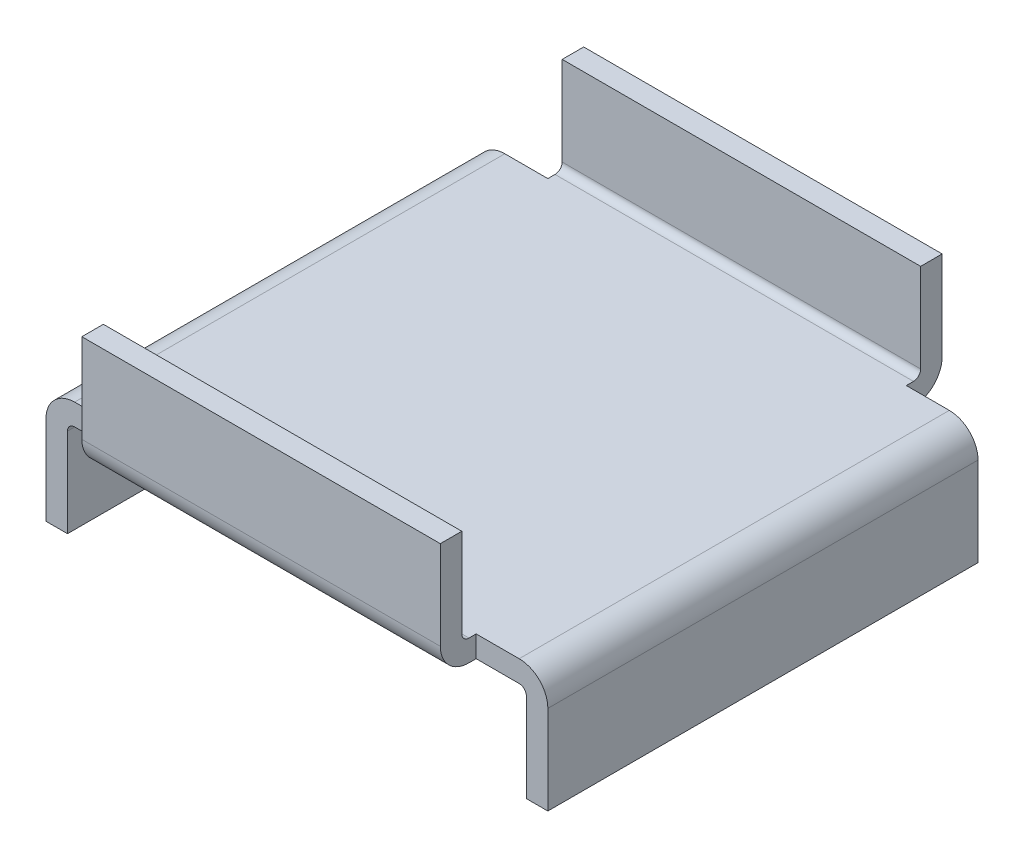
ISO-10303-21;
HEADER;
FILE_DESCRIPTION(('STEP AP214'),'2;1');
FILE_NAME('part.step','',(''),(''),'','','');
FILE_SCHEMA(('AUTOMOTIVE_DESIGN { 1 0 10303 214 1 1 1 1 }'));
ENDSEC;
DATA;
#1=APPLICATION_CONTEXT('core data for automotive mechanical design processes');
#2=APPLICATION_PROTOCOL_DEFINITION('international standard','automotive_design',2000,#1);
#3=PRODUCT_CONTEXT('',#1,'mechanical');
#4=PRODUCT('Part','Part','',(#3));
#5=PRODUCT_RELATED_PRODUCT_CATEGORY('part','',(#4));
#6=PRODUCT_DEFINITION_FORMATION('','',#4);
#7=PRODUCT_DEFINITION_CONTEXT('part definition',#1,'design');
#8=PRODUCT_DEFINITION('design','',#6,#7);
#9=PRODUCT_DEFINITION_SHAPE('','',#8);
#10=(LENGTH_UNIT() NAMED_UNIT(*) SI_UNIT(.MILLI.,.METRE.));
#11=(NAMED_UNIT(*) PLANE_ANGLE_UNIT() SI_UNIT($,.RADIAN.));
#12=(NAMED_UNIT(*) SI_UNIT($,.STERADIAN.) SOLID_ANGLE_UNIT());
#13=UNCERTAINTY_MEASURE_WITH_UNIT(LENGTH_MEASURE(1.E-05),#10,'distance_accuracy_value','');
#14=(GEOMETRIC_REPRESENTATION_CONTEXT(3) GLOBAL_UNCERTAINTY_ASSIGNED_CONTEXT((#13)) GLOBAL_UNIT_ASSIGNED_CONTEXT((#10,
#11,#12)) REPRESENTATION_CONTEXT('',''));
#15=CARTESIAN_POINT('',(0.,0.,0.));
#16=DIRECTION('',(0.,0.,1.));
#17=DIRECTION('',(1.,0.,0.));
#18=AXIS2_PLACEMENT_3D('',#15,#16,#17);
#19=CARTESIAN_POINT('',(0.,-1.5,0.));
#20=DIRECTION('',(0.,1.,0.));
#21=DIRECTION('',(0.,0.,1.));
#22=AXIS2_PLACEMENT_3D('',#19,#20,#21);
#23=PLANE('',#22);
#24=DIRECTION('',(0.,0.,1.));
#25=VECTOR('',#24,1.);
#26=CARTESIAN_POINT('',(-12.5,-1.5,-17.5));
#27=LINE('',#26,#25);
#28=CARTESIAN_POINT('',(-12.5,-1.5,-15.5));
#29=VERTEX_POINT('',#28);
#30=CARTESIAN_POINT('',(-12.5,-1.5,-15.));
#31=VERTEX_POINT('',#30);
#32=EDGE_CURVE('E326',#29,#31,#27,.T.);
#33=ORIENTED_EDGE('',*,*,#32,.F.);
#34=DIRECTION('',(-1.,0.,0.));
#35=VECTOR('',#34,1.);
#36=CARTESIAN_POINT('',(12.5,-1.5,-15.5));
#37=LINE('',#36,#35);
#38=CARTESIAN_POINT('',(12.5,-1.5,-15.5));
#39=VERTEX_POINT('',#38);
#40=EDGE_CURVE('E390',#29,#39,#37,.F.);
#41=ORIENTED_EDGE('',*,*,#40,.T.);
#42=DIRECTION('',(0.,0.,-1.));
#43=VECTOR('',#42,1.);
#44=CARTESIAN_POINT('',(12.5,-1.5,17.5));
#45=LINE('',#44,#43);
#46=CARTESIAN_POINT('',(12.5,-1.5,-15.));
#47=VERTEX_POINT('',#46);
#48=EDGE_CURVE('E325',#47,#39,#45,.T.);
#49=ORIENTED_EDGE('',*,*,#48,.F.);
#50=DIRECTION('',(-1.,0.,0.));
#51=VECTOR('',#50,1.);
#52=CARTESIAN_POINT('',(17.5,-1.5,-15.));
#53=LINE('',#52,#51);
#54=CARTESIAN_POINT('',(15.5000000000023,-1.5,-15.));
#55=VERTEX_POINT('',#54);
#56=EDGE_CURVE('E260',#55,#47,#53,.T.);
#57=ORIENTED_EDGE('',*,*,#56,.F.);
#58=DIRECTION('',(0.,0.,-1.));
#59=VECTOR('',#58,1.);
#60=CARTESIAN_POINT('',(15.5000000000023,-1.5,15.));
#61=LINE('',#60,#59);
#62=CARTESIAN_POINT('',(15.5000000000023,-1.5,15.));
#63=VERTEX_POINT('',#62);
#64=EDGE_CURVE('E352',#55,#63,#61,.F.);
#65=ORIENTED_EDGE('',*,*,#64,.T.);
#66=DIRECTION('',(-1.,0.,0.));
#67=VECTOR('',#66,1.);
#68=CARTESIAN_POINT('',(17.5,-1.5,15.));
#69=LINE('',#68,#67);
#70=CARTESIAN_POINT('',(12.5,-1.5,15.));
#71=VERTEX_POINT('',#70);
#72=EDGE_CURVE('E250',#63,#71,#69,.T.);
#73=ORIENTED_EDGE('',*,*,#72,.T.);
#74=CARTESIAN_POINT('',(12.5,-1.5,15.5));
#75=VERTEX_POINT('',#74);
#76=EDGE_CURVE('E322',#75,#71,#45,.T.);
#77=ORIENTED_EDGE('',*,*,#76,.F.);
#78=DIRECTION('',(1.,0.,0.));
#79=VECTOR('',#78,1.);
#80=CARTESIAN_POINT('',(-12.5,-1.5,15.5));
#81=LINE('',#80,#79);
#82=CARTESIAN_POINT('',(-12.5,-1.5,15.5));
#83=VERTEX_POINT('',#82);
#84=EDGE_CURVE('E388',#75,#83,#81,.F.);
#85=ORIENTED_EDGE('',*,*,#84,.T.);
#86=CARTESIAN_POINT('',(-12.5,-1.5,14.9999999999995));
#87=VERTEX_POINT('',#86);
#88=EDGE_CURVE('E324',#87,#83,#27,.T.);
#89=ORIENTED_EDGE('',*,*,#88,.F.);
#90=DIRECTION('',(1.,0.,0.));
#91=VECTOR('',#90,1.);
#92=CARTESIAN_POINT('',(-17.5,-1.5,14.9999999999995));
#93=LINE('',#92,#91);
#94=CARTESIAN_POINT('',(-15.5,-1.5,14.9999999999995));
#95=VERTEX_POINT('',#94);
#96=EDGE_CURVE('E285',#95,#87,#93,.T.);
#97=ORIENTED_EDGE('',*,*,#96,.F.);
#98=DIRECTION('',(0.,0.,1.));
#99=VECTOR('',#98,1.);
#100=CARTESIAN_POINT('',(-15.5,-1.5,-15.));
#101=LINE('',#100,#99);
#102=CARTESIAN_POINT('',(-15.5,-1.5,-15.));
#103=VERTEX_POINT('',#102);
#104=EDGE_CURVE('E350',#95,#103,#101,.F.);
#105=ORIENTED_EDGE('',*,*,#104,.T.);
#106=DIRECTION('',(1.,0.,0.));
#107=VECTOR('',#106,1.);
#108=CARTESIAN_POINT('',(-17.5,-1.5,-15.));
#109=LINE('',#108,#107);
#110=EDGE_CURVE('E291',#103,#31,#109,.T.);
#111=ORIENTED_EDGE('',*,*,#110,.T.);
#112=EDGE_LOOP('',(#33,#41,#49,#57,#65,#73,#77,#85,#89,#97,#105,#111));
#113=FACE_BOUND('',#112,.T.);
#114=ADVANCED_FACE('F32',(#113),#23,.F.);
#115=CARTESIAN_POINT('',(12.5,-1.5,17.5));
#116=DIRECTION('',(1.,0.,0.));
#117=DIRECTION('',(0.,0.,-1.));
#118=AXIS2_PLACEMENT_3D('',#115,#116,#117);
#119=PLANE('',#118);
#120=DIRECTION('',(0.,1.,0.));
#121=VECTOR('',#120,1.);
#122=CARTESIAN_POINT('',(12.5,-1.5,17.5));
#123=LINE('',#122,#121);
#124=CARTESIAN_POINT('',(12.5,0.500000000000006,17.5));
#125=VERTEX_POINT('',#124);
#126=CARTESIAN_POINT('',(12.5,6.7,17.5));
#127=VERTEX_POINT('',#126);
#128=EDGE_CURVE('E328',#125,#127,#123,.T.);
#129=ORIENTED_EDGE('',*,*,#128,.F.);
#130=CARTESIAN_POINT('',(12.5,0.500000000000006,15.5));
#131=DIRECTION('',(1.,0.,0.));
#132=DIRECTION('',(0.,0.,-1.));
#133=AXIS2_PLACEMENT_3D('',#130,#131,#132);
#134=CIRCLE('',#133,2.);
#135=EDGE_CURVE('E397',#125,#75,#134,.T.);
#136=ORIENTED_EDGE('',*,*,#135,.T.);
#137=ORIENTED_EDGE('',*,*,#76,.T.);
#138=DIRECTION('',(0.,-1.,0.));
#139=VECTOR('',#138,1.);
#140=CARTESIAN_POINT('',(12.5,-1.5,15.));
#141=LINE('',#140,#139);
#142=CARTESIAN_POINT('',(12.5,0.,15.));
#143=VERTEX_POINT('',#142);
#144=EDGE_CURVE('E243',#143,#71,#141,.T.);
#145=ORIENTED_EDGE('',*,*,#144,.F.);
#146=DIRECTION('',(0.,0.,-1.));
#147=VECTOR('',#146,1.);
#148=CARTESIAN_POINT('',(12.5,0.,16.));
#149=LINE('',#148,#147);
#150=CARTESIAN_POINT('',(12.5,0.,15.5));
#151=VERTEX_POINT('',#150);
#152=EDGE_CURVE('E302',#151,#143,#149,.T.);
#153=ORIENTED_EDGE('',*,*,#152,.F.);
#154=CARTESIAN_POINT('',(12.5,0.5,15.5));
#155=DIRECTION('',(1.,0.,0.));
#156=DIRECTION('',(0.,0.,-1.));
#157=AXIS2_PLACEMENT_3D('',#154,#155,#156);
#158=CIRCLE('',#157,0.5);
#159=CARTESIAN_POINT('',(12.5,0.5,16.));
#160=VERTEX_POINT('',#159);
#161=EDGE_CURVE('E371',#151,#160,#158,.F.);
#162=ORIENTED_EDGE('',*,*,#161,.T.);
#163=DIRECTION('',(0.,-1.,0.));
#164=VECTOR('',#163,1.);
#165=CARTESIAN_POINT('',(12.5,6.7,16.));
#166=LINE('',#165,#164);
#167=CARTESIAN_POINT('',(12.5,6.7,16.));
#168=VERTEX_POINT('',#167);
#169=EDGE_CURVE('E311',#168,#160,#166,.T.);
#170=ORIENTED_EDGE('',*,*,#169,.F.);
#171=DIRECTION('',(0.,0.,-1.));
#172=VECTOR('',#171,1.);
#173=CARTESIAN_POINT('',(12.5,6.7,17.5));
#174=LINE('',#173,#172);
#175=EDGE_CURVE('E332',#127,#168,#174,.T.);
#176=ORIENTED_EDGE('',*,*,#175,.F.);
#177=EDGE_LOOP('',(#129,#136,#137,#145,#153,#162,#170,#176));
#178=FACE_BOUND('',#177,.T.);
#179=ADVANCED_FACE('F515',(#178),#119,.T.);
#180=CARTESIAN_POINT('',(-12.5,-1.5,-17.5));
#181=DIRECTION('',(-1.,0.,0.));
#182=DIRECTION('',(0.,0.,1.));
#183=AXIS2_PLACEMENT_3D('',#180,#181,#182);
#184=PLANE('',#183);
#185=ORIENTED_EDGE('',*,*,#88,.T.);
#186=CARTESIAN_POINT('',(-12.5,0.500000000000006,15.5));
#187=DIRECTION('',(-1.,0.,0.));
#188=DIRECTION('',(0.,0.,1.));
#189=AXIS2_PLACEMENT_3D('',#186,#187,#188);
#190=CIRCLE('',#189,2.);
#191=CARTESIAN_POINT('',(-12.5,0.500000000000006,17.5));
#192=VERTEX_POINT('',#191);
#193=EDGE_CURVE('E399',#83,#192,#190,.T.);
#194=ORIENTED_EDGE('',*,*,#193,.T.);
#195=DIRECTION('',(0.,1.,0.));
#196=VECTOR('',#195,1.);
#197=CARTESIAN_POINT('',(-12.5,-1.5,17.5));
#198=LINE('',#197,#196);
#199=CARTESIAN_POINT('',(-12.5,6.7,17.5));
#200=VERTEX_POINT('',#199);
#201=EDGE_CURVE('E342',#192,#200,#198,.T.);
#202=ORIENTED_EDGE('',*,*,#201,.T.);
#203=DIRECTION('',(0.,0.,1.));
#204=VECTOR('',#203,1.);
#205=CARTESIAN_POINT('',(-12.5,6.7,-17.5));
#206=LINE('',#205,#204);
#207=CARTESIAN_POINT('',(-12.5,6.7,16.));
#208=VERTEX_POINT('',#207);
#209=EDGE_CURVE('E338',#208,#200,#206,.T.);
#210=ORIENTED_EDGE('',*,*,#209,.F.);
#211=DIRECTION('',(0.,-1.,0.));
#212=VECTOR('',#211,1.);
#213=CARTESIAN_POINT('',(-12.5,6.7,16.));
#214=LINE('',#213,#212);
#215=CARTESIAN_POINT('',(-12.5,0.5,16.));
#216=VERTEX_POINT('',#215);
#217=EDGE_CURVE('E301',#208,#216,#214,.T.);
#218=ORIENTED_EDGE('',*,*,#217,.T.);
#219=CARTESIAN_POINT('',(-12.5,0.5,15.5));
#220=DIRECTION('',(-1.,0.,0.));
#221=DIRECTION('',(0.,0.,1.));
#222=AXIS2_PLACEMENT_3D('',#219,#220,#221);
#223=CIRCLE('',#222,0.5);
#224=CARTESIAN_POINT('',(-12.5,0.,15.5));
#225=VERTEX_POINT('',#224);
#226=EDGE_CURVE('E373',#216,#225,#223,.F.);
#227=ORIENTED_EDGE('',*,*,#226,.T.);
#228=DIRECTION('',(0.,0.,-1.));
#229=VECTOR('',#228,1.);
#230=CARTESIAN_POINT('',(-12.5,0.,16.));
#231=LINE('',#230,#229);
#232=CARTESIAN_POINT('',(-12.5,0.,14.9999999999995));
#233=VERTEX_POINT('',#232);
#234=EDGE_CURVE('E306',#225,#233,#231,.T.);
#235=ORIENTED_EDGE('',*,*,#234,.T.);
#236=DIRECTION('',(0.,1.,0.));
#237=VECTOR('',#236,1.);
#238=CARTESIAN_POINT('',(-12.5,0.,14.9999999999995));
#239=LINE('',#238,#237);
#240=EDGE_CURVE('E278',#87,#233,#239,.T.);
#241=ORIENTED_EDGE('',*,*,#240,.F.);
#242=EDGE_LOOP('',(#185,#194,#202,#210,#218,#227,#235,#241));
#243=FACE_BOUND('',#242,.T.);
#244=ADVANCED_FACE('F504',(#243),#184,.T.);
#245=CARTESIAN_POINT('',(0.,6.7,0.));
#246=DIRECTION('',(0.,1.,0.));
#247=DIRECTION('',(0.,0.,1.));
#248=AXIS2_PLACEMENT_3D('',#245,#246,#247);
#249=PLANE('',#248);
#250=DIRECTION('',(1.,0.,0.));
#251=VECTOR('',#250,1.);
#252=CARTESIAN_POINT('',(-12.5,6.7,-16.));
#253=LINE('',#252,#251);
#254=CARTESIAN_POINT('',(-12.5,6.7,-16.));
#255=VERTEX_POINT('',#254);
#256=CARTESIAN_POINT('',(12.5,6.7,-16.));
#257=VERTEX_POINT('',#256);
#258=EDGE_CURVE('E309',#255,#257,#253,.T.);
#259=ORIENTED_EDGE('',*,*,#258,.T.);
#260=CARTESIAN_POINT('',(12.5,6.7,-17.5));
#261=VERTEX_POINT('',#260);
#262=EDGE_CURVE('E331',#257,#261,#174,.T.);
#263=ORIENTED_EDGE('',*,*,#262,.T.);
#264=DIRECTION('',(-1.,0.,0.));
#265=VECTOR('',#264,1.);
#266=CARTESIAN_POINT('',(12.5,6.7,-17.5));
#267=LINE('',#266,#265);
#268=CARTESIAN_POINT('',(-12.5,6.7,-17.5));
#269=VERTEX_POINT('',#268);
#270=EDGE_CURVE('E335',#261,#269,#267,.T.);
#271=ORIENTED_EDGE('',*,*,#270,.T.);
#272=EDGE_CURVE('E339',#269,#255,#206,.T.);
#273=ORIENTED_EDGE('',*,*,#272,.T.);
#274=EDGE_LOOP('',(#259,#263,#271,#273));
#275=FACE_BOUND('',#274,.T.);
#276=ADVANCED_FACE('F455',(#275),#249,.T.);
#277=CARTESIAN_POINT('',(-12.5,-1.5,17.5));
#278=DIRECTION('',(0.,0.,1.));
#279=DIRECTION('',(1.,0.,0.));
#280=AXIS2_PLACEMENT_3D('',#277,#278,#279);
#281=PLANE('',#280);
#282=ORIENTED_EDGE('',*,*,#201,.F.);
#283=DIRECTION('',(1.,0.,0.));
#284=VECTOR('',#283,1.);
#285=CARTESIAN_POINT('',(12.5,0.500000000000006,17.5));
#286=LINE('',#285,#284);
#287=EDGE_CURVE('E394',#192,#125,#286,.T.);
#288=ORIENTED_EDGE('',*,*,#287,.T.);
#289=ORIENTED_EDGE('',*,*,#128,.T.);
#290=DIRECTION('',(1.,0.,0.));
#291=VECTOR('',#290,1.);
#292=CARTESIAN_POINT('',(-12.5,6.7,17.5));
#293=LINE('',#292,#291);
#294=EDGE_CURVE('E319',#200,#127,#293,.T.);
#295=ORIENTED_EDGE('',*,*,#294,.F.);
#296=EDGE_LOOP('',(#282,#288,#289,#295));
#297=FACE_BOUND('',#296,.T.);
#298=ADVANCED_FACE('F528',(#297),#281,.T.);
#299=DIRECTION('',(0.,1.,0.));
#300=VECTOR('',#299,1.);
#301=CARTESIAN_POINT('',(-12.5,-1.5,-17.5));
#302=LINE('',#301,#300);
#303=CARTESIAN_POINT('',(-12.5,0.500000000000006,-17.5));
#304=VERTEX_POINT('',#303);
#305=EDGE_CURVE('E344',#304,#269,#302,.T.);
#306=ORIENTED_EDGE('',*,*,#305,.F.);
#307=CARTESIAN_POINT('',(-12.5,0.500000000000006,-15.5));
#308=DIRECTION('',(-1.,0.,0.));
#309=DIRECTION('',(0.,0.,1.));
#310=AXIS2_PLACEMENT_3D('',#307,#308,#309);
#311=CIRCLE('',#310,2.);
#312=EDGE_CURVE('E386',#304,#29,#311,.T.);
#313=ORIENTED_EDGE('',*,*,#312,.T.);
#314=ORIENTED_EDGE('',*,*,#32,.T.);
#315=DIRECTION('',(0.,-1.,0.));
#316=VECTOR('',#315,1.);
#317=CARTESIAN_POINT('',(-12.5,-1.5,-15.));
#318=LINE('',#317,#316);
#319=CARTESIAN_POINT('',(-12.5,0.,-15.));
#320=VERTEX_POINT('',#319);
#321=EDGE_CURVE('E283',#320,#31,#318,.T.);
#322=ORIENTED_EDGE('',*,*,#321,.F.);
#323=CARTESIAN_POINT('',(-12.5,0.,-15.5));
#324=VERTEX_POINT('',#323);
#325=EDGE_CURVE('E305',#320,#324,#231,.T.);
#326=ORIENTED_EDGE('',*,*,#325,.T.);
#327=CARTESIAN_POINT('',(-12.5,0.5,-15.5));
#328=DIRECTION('',(-1.,0.,0.));
#329=DIRECTION('',(0.,0.,1.));
#330=AXIS2_PLACEMENT_3D('',#327,#328,#329);
#331=CIRCLE('',#330,0.5);
#332=CARTESIAN_POINT('',(-12.5,0.5,-16.));
#333=VERTEX_POINT('',#332);
#334=EDGE_CURVE('E377',#324,#333,#331,.F.);
#335=ORIENTED_EDGE('',*,*,#334,.T.);
#336=DIRECTION('',(0.,1.,0.));
#337=VECTOR('',#336,1.);
#338=CARTESIAN_POINT('',(-12.5,0.,-16.));
#339=LINE('',#338,#337);
#340=EDGE_CURVE('E299',#333,#255,#339,.T.);
#341=ORIENTED_EDGE('',*,*,#340,.T.);
#342=ORIENTED_EDGE('',*,*,#272,.F.);
#343=EDGE_LOOP('',(#306,#313,#314,#322,#326,#335,#341,#342));
#344=FACE_BOUND('',#343,.T.);
#345=ADVANCED_FACE('F451',(#344),#184,.T.);
#346=CARTESIAN_POINT('',(12.5,-1.5,-17.5));
#347=DIRECTION('',(0.,0.,-1.));
#348=DIRECTION('',(-1.,0.,0.));
#349=AXIS2_PLACEMENT_3D('',#346,#347,#348);
#350=PLANE('',#349);
#351=DIRECTION('',(0.,1.,0.));
#352=VECTOR('',#351,1.);
#353=CARTESIAN_POINT('',(12.5,-1.5,-17.5));
#354=LINE('',#353,#352);
#355=CARTESIAN_POINT('',(12.5,0.500000000000006,-17.5));
#356=VERTEX_POINT('',#355);
#357=EDGE_CURVE('E346',#356,#261,#354,.T.);
#358=ORIENTED_EDGE('',*,*,#357,.F.);
#359=DIRECTION('',(-1.,0.,0.));
#360=VECTOR('',#359,1.);
#361=CARTESIAN_POINT('',(-12.5,0.500000000000006,-17.5));
#362=LINE('',#361,#360);
#363=EDGE_CURVE('E383',#356,#304,#362,.T.);
#364=ORIENTED_EDGE('',*,*,#363,.T.);
#365=ORIENTED_EDGE('',*,*,#305,.T.);
#366=ORIENTED_EDGE('',*,*,#270,.F.);
#367=EDGE_LOOP('',(#358,#364,#365,#366));
#368=FACE_BOUND('',#367,.T.);
#369=ADVANCED_FACE('F447',(#368),#350,.T.);
#370=ORIENTED_EDGE('',*,*,#48,.T.);
#371=CARTESIAN_POINT('',(12.5,0.500000000000006,-15.5));
#372=DIRECTION('',(1.,0.,0.));
#373=DIRECTION('',(0.,0.,-1.));
#374=AXIS2_PLACEMENT_3D('',#371,#372,#373);
#375=CIRCLE('',#374,2.);
#376=EDGE_CURVE('E392',#39,#356,#375,.T.);
#377=ORIENTED_EDGE('',*,*,#376,.T.);
#378=ORIENTED_EDGE('',*,*,#357,.T.);
#379=ORIENTED_EDGE('',*,*,#262,.F.);
#380=DIRECTION('',(0.,1.,0.));
#381=VECTOR('',#380,1.);
#382=CARTESIAN_POINT('',(12.5,0.,-16.));
#383=LINE('',#382,#381);
#384=CARTESIAN_POINT('',(12.5,0.5,-16.));
#385=VERTEX_POINT('',#384);
#386=EDGE_CURVE('E298',#385,#257,#383,.T.);
#387=ORIENTED_EDGE('',*,*,#386,.F.);
#388=CARTESIAN_POINT('',(12.5,0.5,-15.5));
#389=DIRECTION('',(1.,0.,0.));
#390=DIRECTION('',(0.,0.,-1.));
#391=AXIS2_PLACEMENT_3D('',#388,#389,#390);
#392=CIRCLE('',#391,0.5);
#393=CARTESIAN_POINT('',(12.5,0.,-15.5));
#394=VERTEX_POINT('',#393);
#395=EDGE_CURVE('E375',#385,#394,#392,.F.);
#396=ORIENTED_EDGE('',*,*,#395,.T.);
#397=CARTESIAN_POINT('',(12.5,0.,-15.));
#398=VERTEX_POINT('',#397);
#399=EDGE_CURVE('E314',#398,#394,#149,.T.);
#400=ORIENTED_EDGE('',*,*,#399,.F.);
#401=DIRECTION('',(0.,1.,0.));
#402=VECTOR('',#401,1.);
#403=CARTESIAN_POINT('',(12.5,0.,-15.));
#404=LINE('',#403,#402);
#405=EDGE_CURVE('E239',#47,#398,#404,.T.);
#406=ORIENTED_EDGE('',*,*,#405,.F.);
#407=EDGE_LOOP('',(#370,#377,#378,#379,#387,#396,#400,#406));
#408=FACE_BOUND('',#407,.T.);
#409=ADVANCED_FACE('F439',(#408),#119,.T.);
#410=DIRECTION('',(1.,0.,0.));
#411=VECTOR('',#410,1.);
#412=CARTESIAN_POINT('',(-12.5,6.7,16.));
#413=LINE('',#412,#411);
#414=EDGE_CURVE('E317',#208,#168,#413,.T.);
#415=ORIENTED_EDGE('',*,*,#414,.F.);
#416=ORIENTED_EDGE('',*,*,#209,.T.);
#417=ORIENTED_EDGE('',*,*,#294,.T.);
#418=ORIENTED_EDGE('',*,*,#175,.T.);
#419=EDGE_LOOP('',(#415,#416,#417,#418));
#420=FACE_BOUND('',#419,.T.);
#421=ADVANCED_FACE('F523',(#420),#249,.T.);
#422=CARTESIAN_POINT('',(-12.5,0.,-16.));
#423=DIRECTION('',(0.,0.,-1.));
#424=DIRECTION('',(-1.,0.,0.));
#425=AXIS2_PLACEMENT_3D('',#422,#423,#424);
#426=PLANE('',#425);
#427=ORIENTED_EDGE('',*,*,#340,.F.);
#428=DIRECTION('',(1.,0.,0.));
#429=VECTOR('',#428,1.);
#430=CARTESIAN_POINT('',(12.5,0.5,-16.));
#431=LINE('',#430,#429);
#432=EDGE_CURVE('E361',#333,#385,#431,.T.);
#433=ORIENTED_EDGE('',*,*,#432,.T.);
#434=ORIENTED_EDGE('',*,*,#386,.T.);
#435=ORIENTED_EDGE('',*,*,#258,.F.);
#436=EDGE_LOOP('',(#427,#433,#434,#435));
#437=FACE_BOUND('',#436,.T.);
#438=ADVANCED_FACE('F461',(#437),#426,.F.);
#439=CARTESIAN_POINT('',(-12.5,0.,16.));
#440=DIRECTION('',(0.,-1.,0.));
#441=DIRECTION('',(0.,0.,-1.));
#442=AXIS2_PLACEMENT_3D('',#439,#440,#441);
#443=PLANE('',#442);
#444=DIRECTION('',(1.,0.,0.));
#445=VECTOR('',#444,1.);
#446=CARTESIAN_POINT('',(-17.5,0.,-15.));
#447=LINE('',#446,#445);
#448=CARTESIAN_POINT('',(-15.5,0.,-15.));
#449=VERTEX_POINT('',#448);
#450=EDGE_CURVE('E294',#449,#320,#447,.T.);
#451=ORIENTED_EDGE('',*,*,#450,.F.);
#452=DIRECTION('',(0.,0.,-1.));
#453=VECTOR('',#452,1.);
#454=CARTESIAN_POINT('',(-15.5,0.,16.));
#455=LINE('',#454,#453);
#456=CARTESIAN_POINT('',(-15.5,0.,14.9999999999995));
#457=VERTEX_POINT('',#456);
#458=EDGE_CURVE('E408',#449,#457,#455,.F.);
#459=ORIENTED_EDGE('',*,*,#458,.T.);
#460=DIRECTION('',(1.,0.,0.));
#461=VECTOR('',#460,1.);
#462=CARTESIAN_POINT('',(-17.5,0.,14.9999999999995));
#463=LINE('',#462,#461);
#464=EDGE_CURVE('E296',#457,#233,#463,.T.);
#465=ORIENTED_EDGE('',*,*,#464,.T.);
#466=ORIENTED_EDGE('',*,*,#234,.F.);
#467=DIRECTION('',(1.,0.,0.));
#468=VECTOR('',#467,1.);
#469=CARTESIAN_POINT('',(12.5,0.,15.5));
#470=LINE('',#469,#468);
#471=EDGE_CURVE('E356',#225,#151,#470,.T.);
#472=ORIENTED_EDGE('',*,*,#471,.T.);
#473=ORIENTED_EDGE('',*,*,#152,.T.);
#474=DIRECTION('',(-1.,0.,0.));
#475=VECTOR('',#474,1.);
#476=CARTESIAN_POINT('',(17.5,0.,15.));
#477=LINE('',#476,#475);
#478=CARTESIAN_POINT('',(15.5,0.,15.));
#479=VERTEX_POINT('',#478);
#480=EDGE_CURVE('E256',#479,#143,#477,.T.);
#481=ORIENTED_EDGE('',*,*,#480,.F.);
#482=DIRECTION('',(0.,0.,1.));
#483=VECTOR('',#482,1.);
#484=CARTESIAN_POINT('',(15.5,0.,16.));
#485=LINE('',#484,#483);
#486=CARTESIAN_POINT('',(15.5,0.,-15.));
#487=VERTEX_POINT('',#486);
#488=EDGE_CURVE('E406',#479,#487,#485,.F.);
#489=ORIENTED_EDGE('',*,*,#488,.T.);
#490=DIRECTION('',(-1.,0.,0.));
#491=VECTOR('',#490,1.);
#492=CARTESIAN_POINT('',(17.5,0.,-15.));
#493=LINE('',#492,#491);
#494=EDGE_CURVE('E258',#487,#398,#493,.T.);
#495=ORIENTED_EDGE('',*,*,#494,.T.);
#496=ORIENTED_EDGE('',*,*,#399,.T.);
#497=DIRECTION('',(1.,0.,0.));
#498=VECTOR('',#497,1.);
#499=CARTESIAN_POINT('',(-12.5,0.,-15.5));
#500=LINE('',#499,#498);
#501=EDGE_CURVE('E354',#394,#324,#500,.F.);
#502=ORIENTED_EDGE('',*,*,#501,.T.);
#503=ORIENTED_EDGE('',*,*,#325,.F.);
#504=EDGE_LOOP('',(#451,#459,#465,#466,#472,#473,#481,#489,#495,#496,#502,#503));
#505=FACE_BOUND('',#504,.T.);
#506=ADVANCED_FACE('F419',(#505),#443,.F.);
#507=CARTESIAN_POINT('',(-12.5,6.7,16.));
#508=DIRECTION('',(0.,0.,1.));
#509=DIRECTION('',(1.,0.,0.));
#510=AXIS2_PLACEMENT_3D('',#507,#508,#509);
#511=PLANE('',#510);
#512=ORIENTED_EDGE('',*,*,#169,.T.);
#513=DIRECTION('',(1.,0.,0.));
#514=VECTOR('',#513,1.);
#515=CARTESIAN_POINT('',(-12.5,0.5,16.));
#516=LINE('',#515,#514);
#517=EDGE_CURVE('E359',#160,#216,#516,.F.);
#518=ORIENTED_EDGE('',*,*,#517,.T.);
#519=ORIENTED_EDGE('',*,*,#217,.F.);
#520=ORIENTED_EDGE('',*,*,#414,.T.);
#521=EDGE_LOOP('',(#512,#518,#519,#520));
#522=FACE_BOUND('',#521,.T.);
#523=ADVANCED_FACE('F518',(#522),#511,.F.);
#524=CARTESIAN_POINT('',(-17.5,0.,14.9999999999995));
#525=DIRECTION('',(0.,0.,-1.));
#526=DIRECTION('',(0.,1.,0.));
#527=AXIS2_PLACEMENT_3D('',#524,#525,#526);
#528=PLANE('',#527);
#529=ORIENTED_EDGE('',*,*,#464,.F.);
#530=CARTESIAN_POINT('',(-15.5,-2.,14.9999999999995));
#531=DIRECTION('',(0.,0.,-1.));
#532=DIRECTION('',(0.,1.,0.));
#533=AXIS2_PLACEMENT_3D('',#530,#531,#532);
#534=CIRCLE('',#533,2.);
#535=CARTESIAN_POINT('',(-17.5,-2.,14.9999999999995));
#536=VERTEX_POINT('',#535);
#537=EDGE_CURVE('E410',#457,#536,#534,.F.);
#538=ORIENTED_EDGE('',*,*,#537,.T.);
#539=DIRECTION('',(0.,1.,0.));
#540=VECTOR('',#539,1.);
#541=CARTESIAN_POINT('',(-17.5,0.,14.9999999999995));
#542=LINE('',#541,#540);
#543=CARTESIAN_POINT('',(-17.4999999999975,-8.2,14.9999999999995));
#544=VERTEX_POINT('',#543);
#545=EDGE_CURVE('E279',#544,#536,#542,.T.);
#546=ORIENTED_EDGE('',*,*,#545,.F.);
#547=DIRECTION('',(-1.,0.,0.));
#548=VECTOR('',#547,1.);
#549=CARTESIAN_POINT('',(-17.4999999999975,-8.2,14.9999999999995));
#550=LINE('',#549,#548);
#551=CARTESIAN_POINT('',(-16.,-8.2,14.9999999999995));
#552=VERTEX_POINT('',#551);
#553=EDGE_CURVE('E262',#552,#544,#550,.T.);
#554=ORIENTED_EDGE('',*,*,#553,.F.);
#555=DIRECTION('',(0.,1.,0.));
#556=VECTOR('',#555,1.);
#557=CARTESIAN_POINT('',(-16.,-8.2,14.9999999999995));
#558=LINE('',#557,#556);
#559=CARTESIAN_POINT('',(-16.,-2.,14.9999999999995));
#560=VERTEX_POINT('',#559);
#561=EDGE_CURVE('E272',#552,#560,#558,.T.);
#562=ORIENTED_EDGE('',*,*,#561,.T.);
#563=CARTESIAN_POINT('',(-15.5,-2.,14.9999999999995));
#564=DIRECTION('',(0.,0.,-1.));
#565=DIRECTION('',(0.,1.,0.));
#566=AXIS2_PLACEMENT_3D('',#563,#564,#565);
#567=CIRCLE('',#566,0.5);
#568=EDGE_CURVE('E379',#560,#95,#567,.T.);
#569=ORIENTED_EDGE('',*,*,#568,.T.);
#570=ORIENTED_EDGE('',*,*,#96,.T.);
#571=ORIENTED_EDGE('',*,*,#240,.T.);
#572=EDGE_LOOP('',(#529,#538,#546,#554,#562,#569,#570,#571));
#573=FACE_BOUND('',#572,.T.);
#574=ADVANCED_FACE('F482',(#573),#528,.F.);
#575=CARTESIAN_POINT('',(-17.5,-1.5,-15.));
#576=DIRECTION('',(0.,0.,1.));
#577=DIRECTION('',(1.,0.,0.));
#578=AXIS2_PLACEMENT_3D('',#575,#576,#577);
#579=PLANE('',#578);
#580=DIRECTION('',(0.,-1.,0.));
#581=VECTOR('',#580,1.);
#582=CARTESIAN_POINT('',(-17.5,-1.5,-15.));
#583=LINE('',#582,#581);
#584=CARTESIAN_POINT('',(-17.5,-2.,-15.));
#585=VERTEX_POINT('',#584);
#586=CARTESIAN_POINT('',(-17.4999999999975,-8.2,-15.));
#587=VERTEX_POINT('',#586);
#588=EDGE_CURVE('E282',#585,#587,#583,.T.);
#589=ORIENTED_EDGE('',*,*,#588,.F.);
#590=CARTESIAN_POINT('',(-15.5,-2.,-15.));
#591=DIRECTION('',(0.,0.,1.));
#592=DIRECTION('',(1.,0.,0.));
#593=AXIS2_PLACEMENT_3D('',#590,#591,#592);
#594=CIRCLE('',#593,2.);
#595=EDGE_CURVE('E404',#585,#449,#594,.F.);
#596=ORIENTED_EDGE('',*,*,#595,.T.);
#597=ORIENTED_EDGE('',*,*,#450,.T.);
#598=ORIENTED_EDGE('',*,*,#321,.T.);
#599=ORIENTED_EDGE('',*,*,#110,.F.);
#600=CARTESIAN_POINT('',(-15.5,-2.,-15.));
#601=DIRECTION('',(0.,0.,1.));
#602=DIRECTION('',(1.,0.,0.));
#603=AXIS2_PLACEMENT_3D('',#600,#601,#602);
#604=CIRCLE('',#603,0.5);
#605=CARTESIAN_POINT('',(-16.,-2.,-15.));
#606=VERTEX_POINT('',#605);
#607=EDGE_CURVE('E381',#103,#606,#604,.T.);
#608=ORIENTED_EDGE('',*,*,#607,.T.);
#609=DIRECTION('',(0.,1.,0.));
#610=VECTOR('',#609,1.);
#611=CARTESIAN_POINT('',(-16.,-8.2,-15.));
#612=LINE('',#611,#610);
#613=CARTESIAN_POINT('',(-16.,-8.2,-15.));
#614=VERTEX_POINT('',#613);
#615=EDGE_CURVE('E275',#614,#606,#612,.T.);
#616=ORIENTED_EDGE('',*,*,#615,.F.);
#617=DIRECTION('',(1.,0.,0.));
#618=VECTOR('',#617,1.);
#619=CARTESIAN_POINT('',(-16.,-8.2,-15.));
#620=LINE('',#619,#618);
#621=EDGE_CURVE('E268',#587,#614,#620,.T.);
#622=ORIENTED_EDGE('',*,*,#621,.F.);
#623=EDGE_LOOP('',(#589,#596,#597,#598,#599,#608,#616,#622));
#624=FACE_BOUND('',#623,.T.);
#625=ADVANCED_FACE('F473',(#624),#579,.F.);
#626=CARTESIAN_POINT('',(-17.5,0.,0.));
#627=DIRECTION('',(1.,0.,0.));
#628=DIRECTION('',(0.,0.,-1.));
#629=AXIS2_PLACEMENT_3D('',#626,#627,#628);
#630=PLANE('',#629);
#631=ORIENTED_EDGE('',*,*,#545,.T.);
#632=DIRECTION('',(0.,0.,-1.));
#633=VECTOR('',#632,1.);
#634=CARTESIAN_POINT('',(-17.5,-2.,0.));
#635=LINE('',#634,#633);
#636=EDGE_CURVE('E401',#536,#585,#635,.T.);
#637=ORIENTED_EDGE('',*,*,#636,.T.);
#638=ORIENTED_EDGE('',*,*,#588,.T.);
#639=DIRECTION('',(0.,0.,-1.));
#640=VECTOR('',#639,1.);
#641=CARTESIAN_POINT('',(-17.4999999999975,-8.2,-15.));
#642=LINE('',#641,#640);
#643=EDGE_CURVE('E265',#544,#587,#642,.T.);
#644=ORIENTED_EDGE('',*,*,#643,.F.);
#645=EDGE_LOOP('',(#631,#637,#638,#644));
#646=FACE_BOUND('',#645,.T.);
#647=ADVANCED_FACE('F486',(#646),#630,.F.);
#648=CARTESIAN_POINT('',(-16.,-8.2,14.9999999999995));
#649=DIRECTION('',(-1.,0.,0.));
#650=DIRECTION('',(0.,-1.,0.));
#651=AXIS2_PLACEMENT_3D('',#648,#649,#650);
#652=PLANE('',#651);
#653=ORIENTED_EDGE('',*,*,#615,.T.);
#654=DIRECTION('',(0.,0.,1.));
#655=VECTOR('',#654,1.);
#656=CARTESIAN_POINT('',(-16.,-2.,14.9999999999995));
#657=LINE('',#656,#655);
#658=EDGE_CURVE('E364',#606,#560,#657,.T.);
#659=ORIENTED_EDGE('',*,*,#658,.T.);
#660=ORIENTED_EDGE('',*,*,#561,.F.);
#661=DIRECTION('',(0.,0.,1.));
#662=VECTOR('',#661,1.);
#663=CARTESIAN_POINT('',(-16.,-8.2,14.9999999999995));
#664=LINE('',#663,#662);
#665=EDGE_CURVE('E270',#614,#552,#664,.T.);
#666=ORIENTED_EDGE('',*,*,#665,.F.);
#667=EDGE_LOOP('',(#653,#659,#660,#666));
#668=FACE_BOUND('',#667,.T.);
#669=ADVANCED_FACE('F494',(#668),#652,.F.);
#670=CARTESIAN_POINT('',(0.,-8.2,0.));
#671=DIRECTION('',(0.,1.,0.));
#672=DIRECTION('',(0.,0.,1.));
#673=AXIS2_PLACEMENT_3D('',#670,#671,#672);
#674=PLANE('',#673);
#675=ORIENTED_EDGE('',*,*,#553,.T.);
#676=ORIENTED_EDGE('',*,*,#643,.T.);
#677=ORIENTED_EDGE('',*,*,#621,.T.);
#678=ORIENTED_EDGE('',*,*,#665,.T.);
#679=EDGE_LOOP('',(#675,#676,#677,#678));
#680=FACE_BOUND('',#679,.T.);
#681=ADVANCED_FACE('F489',(#680),#674,.F.);
#682=CARTESIAN_POINT('',(17.5,0.,-15.));
#683=DIRECTION('',(0.,0.,1.));
#684=DIRECTION('',(1.,0.,0.));
#685=AXIS2_PLACEMENT_3D('',#682,#683,#684);
#686=PLANE('',#685);
#687=ORIENTED_EDGE('',*,*,#494,.F.);
#688=CARTESIAN_POINT('',(15.5,-2.,-15.));
#689=DIRECTION('',(0.,0.,1.));
#690=DIRECTION('',(1.,0.,0.));
#691=AXIS2_PLACEMENT_3D('',#688,#689,#690);
#692=CIRCLE('',#691,2.);
#693=CARTESIAN_POINT('',(17.5,-2.,-15.));
#694=VERTEX_POINT('',#693);
#695=EDGE_CURVE('E11',#487,#694,#692,.F.);
#696=ORIENTED_EDGE('',*,*,#695,.T.);
#697=DIRECTION('',(0.,1.,0.));
#698=VECTOR('',#697,1.);
#699=CARTESIAN_POINT('',(17.5,0.,-15.));
#700=LINE('',#699,#698);
#701=CARTESIAN_POINT('',(17.5,-8.2,-15.));
#702=VERTEX_POINT('',#701);
#703=EDGE_CURVE('E220',#702,#694,#700,.T.);
#704=ORIENTED_EDGE('',*,*,#703,.F.);
#705=DIRECTION('',(1.,0.,0.));
#706=VECTOR('',#705,1.);
#707=CARTESIAN_POINT('',(17.5,-8.2,-15.));
#708=LINE('',#707,#706);
#709=CARTESIAN_POINT('',(16.0000000000023,-8.2,-15.));
#710=VERTEX_POINT('',#709);
#711=EDGE_CURVE('E215',#710,#702,#708,.T.);
#712=ORIENTED_EDGE('',*,*,#711,.F.);
#713=DIRECTION('',(0.,1.,0.));
#714=VECTOR('',#713,1.);
#715=CARTESIAN_POINT('',(16.0000000000023,-8.2,-15.));
#716=LINE('',#715,#714);
#717=CARTESIAN_POINT('',(16.0000000000023,-2.,-15.));
#718=VERTEX_POINT('',#717);
#719=EDGE_CURVE('E219',#710,#718,#716,.T.);
#720=ORIENTED_EDGE('',*,*,#719,.T.);
#721=CARTESIAN_POINT('',(15.5000000000023,-2.,-15.));
#722=DIRECTION('',(0.,0.,1.));
#723=DIRECTION('',(1.,0.,0.));
#724=AXIS2_PLACEMENT_3D('',#721,#722,#723);
#725=CIRCLE('',#724,0.5);
#726=EDGE_CURVE('E367',#718,#55,#725,.T.);
#727=ORIENTED_EDGE('',*,*,#726,.T.);
#728=ORIENTED_EDGE('',*,*,#56,.T.);
#729=ORIENTED_EDGE('',*,*,#405,.T.);
#730=EDGE_LOOP('',(#687,#696,#704,#712,#720,#727,#728,#729));
#731=FACE_BOUND('',#730,.T.);
#732=ADVANCED_FACE('F217',(#731),#686,.F.);
#733=CARTESIAN_POINT('',(17.5,-1.5,15.));
#734=DIRECTION('',(0.,0.,-1.));
#735=DIRECTION('',(-1.,0.,0.));
#736=AXIS2_PLACEMENT_3D('',#733,#734,#735);
#737=PLANE('',#736);
#738=DIRECTION('',(0.,-1.,0.));
#739=VECTOR('',#738,1.);
#740=CARTESIAN_POINT('',(17.5,-1.5,15.));
#741=LINE('',#740,#739);
#742=CARTESIAN_POINT('',(17.5,-2.,15.));
#743=VERTEX_POINT('',#742);
#744=CARTESIAN_POINT('',(17.5,-8.2,15.));
#745=VERTEX_POINT('',#744);
#746=EDGE_CURVE('E249',#743,#745,#741,.T.);
#747=ORIENTED_EDGE('',*,*,#746,.F.);
#748=CARTESIAN_POINT('',(15.5,-2.,15.));
#749=DIRECTION('',(0.,0.,-1.));
#750=DIRECTION('',(-1.,0.,0.));
#751=AXIS2_PLACEMENT_3D('',#748,#749,#750);
#752=CIRCLE('',#751,2.);
#753=EDGE_CURVE('E40',#743,#479,#752,.F.);
#754=ORIENTED_EDGE('',*,*,#753,.T.);
#755=ORIENTED_EDGE('',*,*,#480,.T.);
#756=ORIENTED_EDGE('',*,*,#144,.T.);
#757=ORIENTED_EDGE('',*,*,#72,.F.);
#758=CARTESIAN_POINT('',(15.5000000000023,-2.,15.));
#759=DIRECTION('',(0.,0.,-1.));
#760=DIRECTION('',(-1.,0.,0.));
#761=AXIS2_PLACEMENT_3D('',#758,#759,#760);
#762=CIRCLE('',#761,0.5);
#763=CARTESIAN_POINT('',(16.0000000000023,-2.,15.));
#764=VERTEX_POINT('',#763);
#765=EDGE_CURVE('E369',#63,#764,#762,.T.);
#766=ORIENTED_EDGE('',*,*,#765,.T.);
#767=DIRECTION('',(0.,1.,0.));
#768=VECTOR('',#767,1.);
#769=CARTESIAN_POINT('',(16.0000000000023,-8.2,15.));
#770=LINE('',#769,#768);
#771=CARTESIAN_POINT('',(16.0000000000023,-8.2,15.));
#772=VERTEX_POINT('',#771);
#773=EDGE_CURVE('E240',#772,#764,#770,.T.);
#774=ORIENTED_EDGE('',*,*,#773,.F.);
#775=DIRECTION('',(-1.,0.,0.));
#776=VECTOR('',#775,1.);
#777=CARTESIAN_POINT('',(16.0000000000023,-8.2,15.));
#778=LINE('',#777,#776);
#779=EDGE_CURVE('E230',#745,#772,#778,.T.);
#780=ORIENTED_EDGE('',*,*,#779,.F.);
#781=EDGE_LOOP('',(#747,#754,#755,#756,#757,#766,#774,#780));
#782=FACE_BOUND('',#781,.T.);
#783=ADVANCED_FACE('F416',(#782),#737,.F.);
#784=CARTESIAN_POINT('',(17.5,0.,0.));
#785=DIRECTION('',(-1.,0.,0.));
#786=DIRECTION('',(0.,0.,1.));
#787=AXIS2_PLACEMENT_3D('',#784,#785,#786);
#788=PLANE('',#787);
#789=ORIENTED_EDGE('',*,*,#703,.T.);
#790=DIRECTION('',(0.,0.,1.));
#791=VECTOR('',#790,1.);
#792=CARTESIAN_POINT('',(17.5,-2.,0.));
#793=LINE('',#792,#791);
#794=EDGE_CURVE('E412',#694,#743,#793,.T.);
#795=ORIENTED_EDGE('',*,*,#794,.T.);
#796=ORIENTED_EDGE('',*,*,#746,.T.);
#797=DIRECTION('',(0.,0.,1.));
#798=VECTOR('',#797,1.);
#799=CARTESIAN_POINT('',(17.5,-8.2,15.));
#800=LINE('',#799,#798);
#801=EDGE_CURVE('E224',#702,#745,#800,.T.);
#802=ORIENTED_EDGE('',*,*,#801,.F.);
#803=EDGE_LOOP('',(#789,#795,#796,#802));
#804=FACE_BOUND('',#803,.T.);
#805=ADVANCED_FACE('F423',(#804),#788,.F.);
#806=CARTESIAN_POINT('',(16.0000000000023,-8.2,-15.));
#807=DIRECTION('',(1.,0.,0.));
#808=DIRECTION('',(0.,1.,0.));
#809=AXIS2_PLACEMENT_3D('',#806,#807,#808);
#810=PLANE('',#809);
#811=ORIENTED_EDGE('',*,*,#773,.T.);
#812=DIRECTION('',(0.,0.,-1.));
#813=VECTOR('',#812,1.);
#814=CARTESIAN_POINT('',(16.0000000000023,-2.,-15.));
#815=LINE('',#814,#813);
#816=EDGE_CURVE('E238',#764,#718,#815,.T.);
#817=ORIENTED_EDGE('',*,*,#816,.T.);
#818=ORIENTED_EDGE('',*,*,#719,.F.);
#819=DIRECTION('',(0.,0.,-1.));
#820=VECTOR('',#819,1.);
#821=CARTESIAN_POINT('',(16.0000000000023,-8.2,-15.));
#822=LINE('',#821,#820);
#823=EDGE_CURVE('E225',#772,#710,#822,.T.);
#824=ORIENTED_EDGE('',*,*,#823,.F.);
#825=EDGE_LOOP('',(#811,#817,#818,#824));
#826=FACE_BOUND('',#825,.T.);
#827=ADVANCED_FACE('F236',(#826),#810,.F.);
#828=CARTESIAN_POINT('',(0.,-8.2,0.));
#829=DIRECTION('',(0.,1.,0.));
#830=DIRECTION('',(0.,0.,1.));
#831=AXIS2_PLACEMENT_3D('',#828,#829,#830);
#832=PLANE('',#831);
#833=ORIENTED_EDGE('',*,*,#823,.T.);
#834=ORIENTED_EDGE('',*,*,#711,.T.);
#835=ORIENTED_EDGE('',*,*,#801,.T.);
#836=ORIENTED_EDGE('',*,*,#779,.T.);
#837=EDGE_LOOP('',(#833,#834,#835,#836));
#838=FACE_BOUND('',#837,.T.);
#839=ADVANCED_FACE('F228',(#838),#832,.F.);
#840=CARTESIAN_POINT('',(15.5000000000023,-2.,-15.));
#841=DIRECTION('',(0.,0.,1.));
#842=DIRECTION('',(1.,0.,0.));
#843=AXIS2_PLACEMENT_3D('',#840,#841,#842);
#844=CYLINDRICAL_SURFACE('',#843,0.5);
#845=ORIENTED_EDGE('',*,*,#765,.F.);
#846=ORIENTED_EDGE('',*,*,#64,.F.);
#847=ORIENTED_EDGE('',*,*,#726,.F.);
#848=ORIENTED_EDGE('',*,*,#816,.F.);
#849=EDGE_LOOP('',(#845,#846,#847,#848));
#850=FACE_BOUND('',#849,.T.);
#851=ADVANCED_FACE('F428',(#850),#844,.F.);
#852=CARTESIAN_POINT('',(-12.5,0.5,15.5));
#853=DIRECTION('',(-1.,0.,0.));
#854=DIRECTION('',(0.,0.,1.));
#855=AXIS2_PLACEMENT_3D('',#852,#853,#854);
#856=CYLINDRICAL_SURFACE('',#855,0.5);
#857=ORIENTED_EDGE('',*,*,#226,.F.);
#858=ORIENTED_EDGE('',*,*,#517,.F.);
#859=ORIENTED_EDGE('',*,*,#161,.F.);
#860=ORIENTED_EDGE('',*,*,#471,.F.);
#861=EDGE_LOOP('',(#857,#858,#859,#860));
#862=FACE_BOUND('',#861,.T.);
#863=ADVANCED_FACE('F510',(#862),#856,.F.);
#864=CARTESIAN_POINT('',(-12.5,0.5,-15.5));
#865=DIRECTION('',(-1.,0.,0.));
#866=DIRECTION('',(0.,0.,1.));
#867=AXIS2_PLACEMENT_3D('',#864,#865,#866);
#868=CYLINDRICAL_SURFACE('',#867,0.5);
#869=ORIENTED_EDGE('',*,*,#334,.F.);
#870=ORIENTED_EDGE('',*,*,#501,.F.);
#871=ORIENTED_EDGE('',*,*,#395,.F.);
#872=ORIENTED_EDGE('',*,*,#432,.F.);
#873=EDGE_LOOP('',(#869,#870,#871,#872));
#874=FACE_BOUND('',#873,.T.);
#875=ADVANCED_FACE('F465',(#874),#868,.F.);
#876=CARTESIAN_POINT('',(-15.5,-2.,14.9999999999995));
#877=DIRECTION('',(0.,0.,-1.));
#878=DIRECTION('',(-1.,0.,0.));
#879=AXIS2_PLACEMENT_3D('',#876,#877,#878);
#880=CYLINDRICAL_SURFACE('',#879,0.5);
#881=ORIENTED_EDGE('',*,*,#607,.F.);
#882=ORIENTED_EDGE('',*,*,#104,.F.);
#883=ORIENTED_EDGE('',*,*,#568,.F.);
#884=ORIENTED_EDGE('',*,*,#658,.F.);
#885=EDGE_LOOP('',(#881,#882,#883,#884));
#886=FACE_BOUND('',#885,.T.);
#887=ADVANCED_FACE('F498',(#886),#880,.F.);
#888=CARTESIAN_POINT('',(12.5,0.500000000000006,-15.5));
#889=DIRECTION('',(1.,0.,0.));
#890=DIRECTION('',(0.,0.,-1.));
#891=AXIS2_PLACEMENT_3D('',#888,#889,#890);
#892=CYLINDRICAL_SURFACE('',#891,2.);
#893=ORIENTED_EDGE('',*,*,#376,.F.);
#894=ORIENTED_EDGE('',*,*,#40,.F.);
#895=ORIENTED_EDGE('',*,*,#312,.F.);
#896=ORIENTED_EDGE('',*,*,#363,.F.);
#897=EDGE_LOOP('',(#893,#894,#895,#896));
#898=FACE_BOUND('',#897,.T.);
#899=ADVANCED_FACE('F444',(#898),#892,.T.);
#900=CARTESIAN_POINT('',(-12.5,0.500000000000006,15.5));
#901=DIRECTION('',(-1.,0.,0.));
#902=DIRECTION('',(0.,0.,1.));
#903=AXIS2_PLACEMENT_3D('',#900,#901,#902);
#904=CYLINDRICAL_SURFACE('',#903,2.);
#905=ORIENTED_EDGE('',*,*,#193,.F.);
#906=ORIENTED_EDGE('',*,*,#84,.F.);
#907=ORIENTED_EDGE('',*,*,#135,.F.);
#908=ORIENTED_EDGE('',*,*,#287,.F.);
#909=EDGE_LOOP('',(#905,#906,#907,#908));
#910=FACE_BOUND('',#909,.T.);
#911=ADVANCED_FACE('F530',(#910),#904,.T.);
#912=CARTESIAN_POINT('',(-15.5,-2.,0.));
#913=DIRECTION('',(0.,0.,-1.));
#914=DIRECTION('',(-1.,0.,0.));
#915=AXIS2_PLACEMENT_3D('',#912,#913,#914);
#916=CYLINDRICAL_SURFACE('',#915,2.);
#917=ORIENTED_EDGE('',*,*,#537,.F.);
#918=ORIENTED_EDGE('',*,*,#458,.F.);
#919=ORIENTED_EDGE('',*,*,#595,.F.);
#920=ORIENTED_EDGE('',*,*,#636,.F.);
#921=EDGE_LOOP('',(#917,#918,#919,#920));
#922=FACE_BOUND('',#921,.T.);
#923=ADVANCED_FACE('F479',(#922),#916,.T.);
#924=CARTESIAN_POINT('',(15.5,-2.,0.));
#925=DIRECTION('',(0.,0.,1.));
#926=DIRECTION('',(1.,0.,0.));
#927=AXIS2_PLACEMENT_3D('',#924,#925,#926);
#928=CYLINDRICAL_SURFACE('',#927,2.);
#929=ORIENTED_EDGE('',*,*,#695,.F.);
#930=ORIENTED_EDGE('',*,*,#488,.F.);
#931=ORIENTED_EDGE('',*,*,#753,.F.);
#932=ORIENTED_EDGE('',*,*,#794,.F.);
#933=EDGE_LOOP('',(#929,#930,#931,#932));
#934=FACE_BOUND('',#933,.T.);
#935=ADVANCED_FACE('F34',(#934),#928,.T.);
#936=CLOSED_SHELL('',(#114,#179,#244,#276,#298,#345,#369,#409,#421,#438,#506,#523,#574,#625,
#647,#669,#681,#732,#783,#805,#827,#839,#851,#863,#875,#887,#899,#911,#923,#935));
#937=MANIFOLD_SOLID_BREP('B2',#936);
#938=ADVANCED_BREP_SHAPE_REPRESENTATION('',(#18,#937),#14);
#939=SHAPE_DEFINITION_REPRESENTATION(#9,#938);
ENDSEC;
END-ISO-10303-21;
